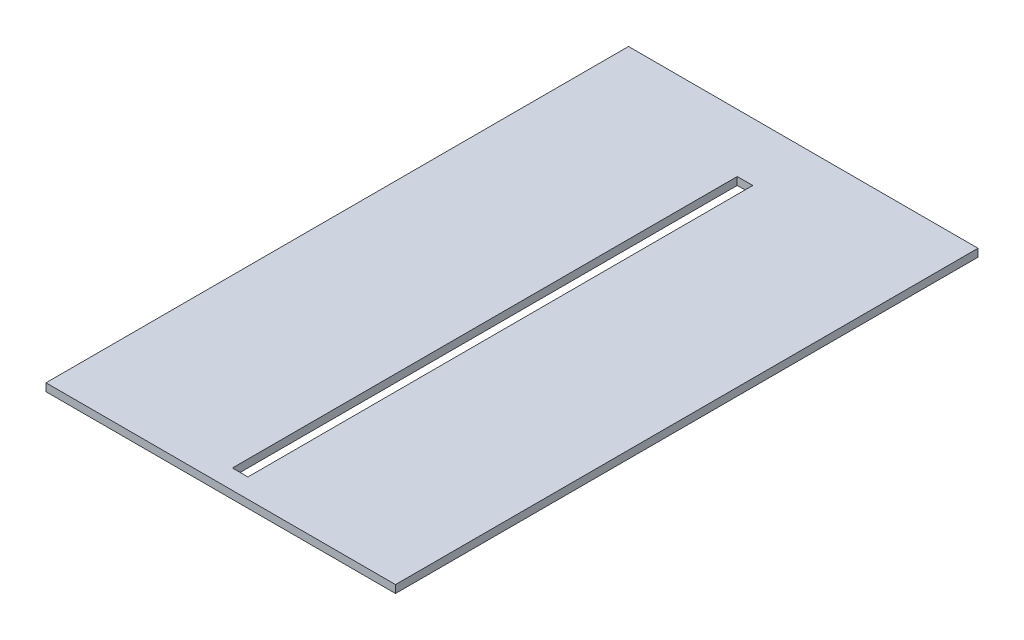
ISO-10303-21;
HEADER;
FILE_DESCRIPTION(('STEP AP214'),'2;1');
FILE_NAME('part.step','',(''),(''),'','','');
FILE_SCHEMA(('AUTOMOTIVE_DESIGN { 1 0 10303 214 1 1 1 1 }'));
ENDSEC;
DATA;
#1=APPLICATION_CONTEXT('core data for automotive mechanical design processes');
#2=APPLICATION_PROTOCOL_DEFINITION('international standard','automotive_design',2000,#1);
#3=PRODUCT_CONTEXT('',#1,'mechanical');
#4=PRODUCT('Part','Part','',(#3));
#5=PRODUCT_RELATED_PRODUCT_CATEGORY('part','',(#4));
#6=PRODUCT_DEFINITION_FORMATION('','',#4);
#7=PRODUCT_DEFINITION_CONTEXT('part definition',#1,'design');
#8=PRODUCT_DEFINITION('design','',#6,#7);
#9=PRODUCT_DEFINITION_SHAPE('','',#8);
#10=(LENGTH_UNIT() NAMED_UNIT(*) SI_UNIT(.MILLI.,.METRE.));
#11=(NAMED_UNIT(*) PLANE_ANGLE_UNIT() SI_UNIT($,.RADIAN.));
#12=(NAMED_UNIT(*) SI_UNIT($,.STERADIAN.) SOLID_ANGLE_UNIT());
#13=UNCERTAINTY_MEASURE_WITH_UNIT(LENGTH_MEASURE(1.E-05),#10,'distance_accuracy_value','');
#14=(GEOMETRIC_REPRESENTATION_CONTEXT(3) GLOBAL_UNCERTAINTY_ASSIGNED_CONTEXT((#13)) GLOBAL_UNIT_ASSIGNED_CONTEXT((#10,
#11,#12)) REPRESENTATION_CONTEXT('',''));
#15=CARTESIAN_POINT('',(0.,0.,0.));
#16=DIRECTION('',(0.,0.,1.));
#17=DIRECTION('',(1.,0.,0.));
#18=AXIS2_PLACEMENT_3D('',#15,#16,#17);
#19=CARTESIAN_POINT('',(0.,10.,0.));
#20=DIRECTION('',(0.,-1.,0.));
#21=DIRECTION('',(0.,0.,-1.));
#22=AXIS2_PLACEMENT_3D('',#19,#20,#21);
#23=PLANE('',#22);
#24=DIRECTION('',(0.,0.,-1.));
#25=VECTOR('',#24,1.);
#26=CARTESIAN_POINT('',(225.,10.,375.));
#27=LINE('',#26,#25);
#28=CARTESIAN_POINT('',(225.,10.,375.));
#29=VERTEX_POINT('',#28);
#30=CARTESIAN_POINT('',(225.,10.,-375.));
#31=VERTEX_POINT('',#30);
#32=EDGE_CURVE('E153',#29,#31,#27,.T.);
#33=ORIENTED_EDGE('',*,*,#32,.T.);
#34=DIRECTION('',(-1.,0.,0.));
#35=VECTOR('',#34,1.);
#36=CARTESIAN_POINT('',(-225.,10.,-375.));
#37=LINE('',#36,#35);
#38=CARTESIAN_POINT('',(-225.,10.,-375.));
#39=VERTEX_POINT('',#38);
#40=EDGE_CURVE('E157',#31,#39,#37,.T.);
#41=ORIENTED_EDGE('',*,*,#40,.T.);
#42=DIRECTION('',(0.,0.,1.));
#43=VECTOR('',#42,1.);
#44=CARTESIAN_POINT('',(-225.,10.,375.));
#45=LINE('',#44,#43);
#46=CARTESIAN_POINT('',(-225.,10.,375.));
#47=VERTEX_POINT('',#46);
#48=EDGE_CURVE('E161',#39,#47,#45,.T.);
#49=ORIENTED_EDGE('',*,*,#48,.T.);
#50=DIRECTION('',(1.,0.,0.));
#51=VECTOR('',#50,1.);
#52=CARTESIAN_POINT('',(-225.,10.,375.));
#53=LINE('',#52,#51);
#54=EDGE_CURVE('E164',#47,#29,#53,.T.);
#55=ORIENTED_EDGE('',*,*,#54,.T.);
#56=EDGE_LOOP('',(#33,#41,#49,#55));
#57=FACE_BOUND('',#56,.T.);
#58=DIRECTION('',(0.,0.,1.));
#59=VECTOR('',#58,1.);
#60=CARTESIAN_POINT('',(-10.,10.,-300.000000000001));
#61=LINE('',#60,#59);
#62=CARTESIAN_POINT('',(-10.,10.,-300.000000000001));
#63=VERTEX_POINT('',#62);
#64=CARTESIAN_POINT('',(-10.,10.,350.));
#65=VERTEX_POINT('',#64);
#66=EDGE_CURVE('E105',#63,#65,#61,.T.);
#67=ORIENTED_EDGE('',*,*,#66,.F.);
#68=DIRECTION('',(-1.,0.,0.));
#69=VECTOR('',#68,1.);
#70=CARTESIAN_POINT('',(-10.,10.,-300.000000000001));
#71=LINE('',#70,#69);
#72=CARTESIAN_POINT('',(9.99999999999997,10.,-300.000000000001));
#73=VERTEX_POINT('',#72);
#74=EDGE_CURVE('E131',#73,#63,#71,.T.);
#75=ORIENTED_EDGE('',*,*,#74,.F.);
#76=DIRECTION('',(0.,0.,-1.));
#77=VECTOR('',#76,1.);
#78=CARTESIAN_POINT('',(9.99999999999997,10.,-300.000000000001));
#79=LINE('',#78,#77);
#80=CARTESIAN_POINT('',(9.99999999999997,10.,350.));
#81=VERTEX_POINT('',#80);
#82=EDGE_CURVE('E127',#81,#73,#79,.T.);
#83=ORIENTED_EDGE('',*,*,#82,.F.);
#84=DIRECTION('',(1.,0.,0.));
#85=VECTOR('',#84,1.);
#86=CARTESIAN_POINT('',(-10.,10.,350.));
#87=LINE('',#86,#85);
#88=EDGE_CURVE('E114',#65,#81,#87,.T.);
#89=ORIENTED_EDGE('',*,*,#88,.F.);
#90=EDGE_LOOP('',(#67,#75,#83,#89));
#91=FACE_BOUND('',#90,.T.);
#92=ADVANCED_FACE('F39',(#57,#91),#23,.F.);
#93=CARTESIAN_POINT('',(0.,0.,0.));
#94=DIRECTION('',(0.,-1.,0.));
#95=DIRECTION('',(0.,0.,-1.));
#96=AXIS2_PLACEMENT_3D('',#93,#94,#95);
#97=PLANE('',#96);
#98=DIRECTION('',(0.,0.,-1.));
#99=VECTOR('',#98,1.);
#100=CARTESIAN_POINT('',(225.,0.,375.));
#101=LINE('',#100,#99);
#102=CARTESIAN_POINT('',(225.,0.,375.));
#103=VERTEX_POINT('',#102);
#104=CARTESIAN_POINT('',(225.,0.,-375.));
#105=VERTEX_POINT('',#104);
#106=EDGE_CURVE('E123',#103,#105,#101,.T.);
#107=ORIENTED_EDGE('',*,*,#106,.F.);
#108=DIRECTION('',(1.,0.,0.));
#109=VECTOR('',#108,1.);
#110=CARTESIAN_POINT('',(-225.,0.,375.));
#111=LINE('',#110,#109);
#112=CARTESIAN_POINT('',(-225.,0.,375.));
#113=VERTEX_POINT('',#112);
#114=EDGE_CURVE('E158',#113,#103,#111,.T.);
#115=ORIENTED_EDGE('',*,*,#114,.F.);
#116=DIRECTION('',(0.,0.,1.));
#117=VECTOR('',#116,1.);
#118=CARTESIAN_POINT('',(-225.,0.,375.));
#119=LINE('',#118,#117);
#120=CARTESIAN_POINT('',(-225.,0.,-375.));
#121=VERTEX_POINT('',#120);
#122=EDGE_CURVE('E174',#121,#113,#119,.T.);
#123=ORIENTED_EDGE('',*,*,#122,.F.);
#124=DIRECTION('',(-1.,0.,0.));
#125=VECTOR('',#124,1.);
#126=CARTESIAN_POINT('',(-225.,0.,-375.));
#127=LINE('',#126,#125);
#128=EDGE_CURVE('E171',#105,#121,#127,.T.);
#129=ORIENTED_EDGE('',*,*,#128,.F.);
#130=EDGE_LOOP('',(#107,#115,#123,#129));
#131=FACE_BOUND('',#130,.T.);
#132=DIRECTION('',(-1.,0.,0.));
#133=VECTOR('',#132,1.);
#134=CARTESIAN_POINT('',(-10.,0.,-300.000000000001));
#135=LINE('',#134,#133);
#136=CARTESIAN_POINT('',(9.99999999999997,0.,-300.000000000001));
#137=VERTEX_POINT('',#136);
#138=CARTESIAN_POINT('',(-10.,0.,-300.000000000001));
#139=VERTEX_POINT('',#138);
#140=EDGE_CURVE('E115',#137,#139,#135,.T.);
#141=ORIENTED_EDGE('',*,*,#140,.T.);
#142=DIRECTION('',(0.,0.,1.));
#143=VECTOR('',#142,1.);
#144=CARTESIAN_POINT('',(-10.,0.,-300.000000000001));
#145=LINE('',#144,#143);
#146=CARTESIAN_POINT('',(-10.,0.,350.));
#147=VERTEX_POINT('',#146);
#148=EDGE_CURVE('E63',#139,#147,#145,.T.);
#149=ORIENTED_EDGE('',*,*,#148,.T.);
#150=DIRECTION('',(1.,0.,0.));
#151=VECTOR('',#150,1.);
#152=CARTESIAN_POINT('',(-10.,0.,350.));
#153=LINE('',#152,#151);
#154=CARTESIAN_POINT('',(9.99999999999997,0.,350.));
#155=VERTEX_POINT('',#154);
#156=EDGE_CURVE('E121',#147,#155,#153,.T.);
#157=ORIENTED_EDGE('',*,*,#156,.T.);
#158=DIRECTION('',(0.,0.,-1.));
#159=VECTOR('',#158,1.);
#160=CARTESIAN_POINT('',(9.99999999999997,0.,-300.000000000001));
#161=LINE('',#160,#159);
#162=EDGE_CURVE('E140',#155,#137,#161,.T.);
#163=ORIENTED_EDGE('',*,*,#162,.T.);
#164=EDGE_LOOP('',(#141,#149,#157,#163));
#165=FACE_BOUND('',#164,.T.);
#166=ADVANCED_FACE('F197',(#131,#165),#97,.T.);
#167=CARTESIAN_POINT('',(225.,10.,375.));
#168=DIRECTION('',(-1.,0.,0.));
#169=DIRECTION('',(0.,0.,1.));
#170=AXIS2_PLACEMENT_3D('',#167,#168,#169);
#171=PLANE('',#170);
#172=ORIENTED_EDGE('',*,*,#106,.T.);
#173=DIRECTION('',(0.,-1.,0.));
#174=VECTOR('',#173,1.);
#175=CARTESIAN_POINT('',(225.,10.,-375.));
#176=LINE('',#175,#174);
#177=EDGE_CURVE('E11',#31,#105,#176,.T.);
#178=ORIENTED_EDGE('',*,*,#177,.F.);
#179=ORIENTED_EDGE('',*,*,#32,.F.);
#180=DIRECTION('',(0.,-1.,0.));
#181=VECTOR('',#180,1.);
#182=CARTESIAN_POINT('',(225.,10.,375.));
#183=LINE('',#182,#181);
#184=EDGE_CURVE('E167',#29,#103,#183,.T.);
#185=ORIENTED_EDGE('',*,*,#184,.T.);
#186=EDGE_LOOP('',(#172,#178,#179,#185));
#187=FACE_BOUND('',#186,.T.);
#188=ADVANCED_FACE('F41',(#187),#171,.F.);
#189=CARTESIAN_POINT('',(-225.,10.,-375.));
#190=DIRECTION('',(0.,0.,1.));
#191=DIRECTION('',(1.,0.,0.));
#192=AXIS2_PLACEMENT_3D('',#189,#190,#191);
#193=PLANE('',#192);
#194=ORIENTED_EDGE('',*,*,#128,.T.);
#195=DIRECTION('',(0.,-1.,0.));
#196=VECTOR('',#195,1.);
#197=CARTESIAN_POINT('',(-225.,10.,-375.));
#198=LINE('',#197,#196);
#199=EDGE_CURVE('E48',#39,#121,#198,.T.);
#200=ORIENTED_EDGE('',*,*,#199,.F.);
#201=ORIENTED_EDGE('',*,*,#40,.F.);
#202=ORIENTED_EDGE('',*,*,#177,.T.);
#203=EDGE_LOOP('',(#194,#200,#201,#202));
#204=FACE_BOUND('',#203,.T.);
#205=ADVANCED_FACE('F207',(#204),#193,.F.);
#206=CARTESIAN_POINT('',(-225.,10.,375.));
#207=DIRECTION('',(1.,0.,0.));
#208=DIRECTION('',(0.,0.,-1.));
#209=AXIS2_PLACEMENT_3D('',#206,#207,#208);
#210=PLANE('',#209);
#211=ORIENTED_EDGE('',*,*,#122,.T.);
#212=DIRECTION('',(0.,-1.,0.));
#213=VECTOR('',#212,1.);
#214=CARTESIAN_POINT('',(-225.,10.,375.));
#215=LINE('',#214,#213);
#216=EDGE_CURVE('E182',#47,#113,#215,.T.);
#217=ORIENTED_EDGE('',*,*,#216,.F.);
#218=ORIENTED_EDGE('',*,*,#48,.F.);
#219=ORIENTED_EDGE('',*,*,#199,.T.);
#220=EDGE_LOOP('',(#211,#217,#218,#219));
#221=FACE_BOUND('',#220,.T.);
#222=ADVANCED_FACE('F191',(#221),#210,.F.);
#223=CARTESIAN_POINT('',(-225.,10.,375.));
#224=DIRECTION('',(0.,0.,-1.));
#225=DIRECTION('',(-1.,0.,0.));
#226=AXIS2_PLACEMENT_3D('',#223,#224,#225);
#227=PLANE('',#226);
#228=ORIENTED_EDGE('',*,*,#114,.T.);
#229=ORIENTED_EDGE('',*,*,#184,.F.);
#230=ORIENTED_EDGE('',*,*,#54,.F.);
#231=ORIENTED_EDGE('',*,*,#216,.T.);
#232=EDGE_LOOP('',(#228,#229,#230,#231));
#233=FACE_BOUND('',#232,.T.);
#234=ADVANCED_FACE('F201',(#233),#227,.F.);
#235=CARTESIAN_POINT('',(-10.,10.,-300.000000000001));
#236=DIRECTION('',(1.,0.,0.));
#237=DIRECTION('',(0.,0.,-1.));
#238=AXIS2_PLACEMENT_3D('',#235,#236,#237);
#239=PLANE('',#238);
#240=ORIENTED_EDGE('',*,*,#148,.F.);
#241=DIRECTION('',(0.,-1.,0.));
#242=VECTOR('',#241,1.);
#243=CARTESIAN_POINT('',(-10.,10.,-300.000000000001));
#244=LINE('',#243,#242);
#245=EDGE_CURVE('E109',#63,#139,#244,.T.);
#246=ORIENTED_EDGE('',*,*,#245,.F.);
#247=ORIENTED_EDGE('',*,*,#66,.T.);
#248=DIRECTION('',(0.,-1.,0.));
#249=VECTOR('',#248,1.);
#250=CARTESIAN_POINT('',(-10.,10.,350.));
#251=LINE('',#250,#249);
#252=EDGE_CURVE('E108',#65,#147,#251,.T.);
#253=ORIENTED_EDGE('',*,*,#252,.T.);
#254=EDGE_LOOP('',(#240,#246,#247,#253));
#255=FACE_BOUND('',#254,.T.);
#256=ADVANCED_FACE('F107',(#255),#239,.T.);
#257=CARTESIAN_POINT('',(-10.,10.,350.));
#258=DIRECTION('',(0.,0.,-1.));
#259=DIRECTION('',(-1.,0.,0.));
#260=AXIS2_PLACEMENT_3D('',#257,#258,#259);
#261=PLANE('',#260);
#262=ORIENTED_EDGE('',*,*,#156,.F.);
#263=ORIENTED_EDGE('',*,*,#252,.F.);
#264=ORIENTED_EDGE('',*,*,#88,.T.);
#265=DIRECTION('',(0.,-1.,0.));
#266=VECTOR('',#265,1.);
#267=CARTESIAN_POINT('',(9.99999999999997,10.,350.));
#268=LINE('',#267,#266);
#269=EDGE_CURVE('E124',#81,#155,#268,.T.);
#270=ORIENTED_EDGE('',*,*,#269,.T.);
#271=EDGE_LOOP('',(#262,#263,#264,#270));
#272=FACE_BOUND('',#271,.T.);
#273=ADVANCED_FACE('F118',(#272),#261,.T.);
#274=CARTESIAN_POINT('',(9.99999999999997,10.,-300.000000000001));
#275=DIRECTION('',(-1.,0.,0.));
#276=DIRECTION('',(0.,0.,1.));
#277=AXIS2_PLACEMENT_3D('',#274,#275,#276);
#278=PLANE('',#277);
#279=ORIENTED_EDGE('',*,*,#162,.F.);
#280=ORIENTED_EDGE('',*,*,#269,.F.);
#281=ORIENTED_EDGE('',*,*,#82,.T.);
#282=DIRECTION('',(0.,-1.,0.));
#283=VECTOR('',#282,1.);
#284=CARTESIAN_POINT('',(9.99999999999997,10.,-300.000000000001));
#285=LINE('',#284,#283);
#286=EDGE_CURVE('E55',#73,#137,#285,.T.);
#287=ORIENTED_EDGE('',*,*,#286,.T.);
#288=EDGE_LOOP('',(#279,#280,#281,#287));
#289=FACE_BOUND('',#288,.T.);
#290=ADVANCED_FACE('F230',(#289),#278,.T.);
#291=CARTESIAN_POINT('',(-10.,10.,-300.000000000001));
#292=DIRECTION('',(0.,0.,1.));
#293=DIRECTION('',(1.,0.,0.));
#294=AXIS2_PLACEMENT_3D('',#291,#292,#293);
#295=PLANE('',#294);
#296=ORIENTED_EDGE('',*,*,#140,.F.);
#297=ORIENTED_EDGE('',*,*,#286,.F.);
#298=ORIENTED_EDGE('',*,*,#74,.T.);
#299=ORIENTED_EDGE('',*,*,#245,.T.);
#300=EDGE_LOOP('',(#296,#297,#298,#299));
#301=FACE_BOUND('',#300,.T.);
#302=ADVANCED_FACE('F234',(#301),#295,.T.);
#303=CLOSED_SHELL('',(#92,#166,#188,#205,#222,#234,#256,#273,#290,#302));
#304=MANIFOLD_SOLID_BREP('B2',#303);
#305=ADVANCED_BREP_SHAPE_REPRESENTATION('',(#18,#304),#14);
#306=SHAPE_DEFINITION_REPRESENTATION(#9,#305);
ENDSEC;
END-ISO-10303-21;
